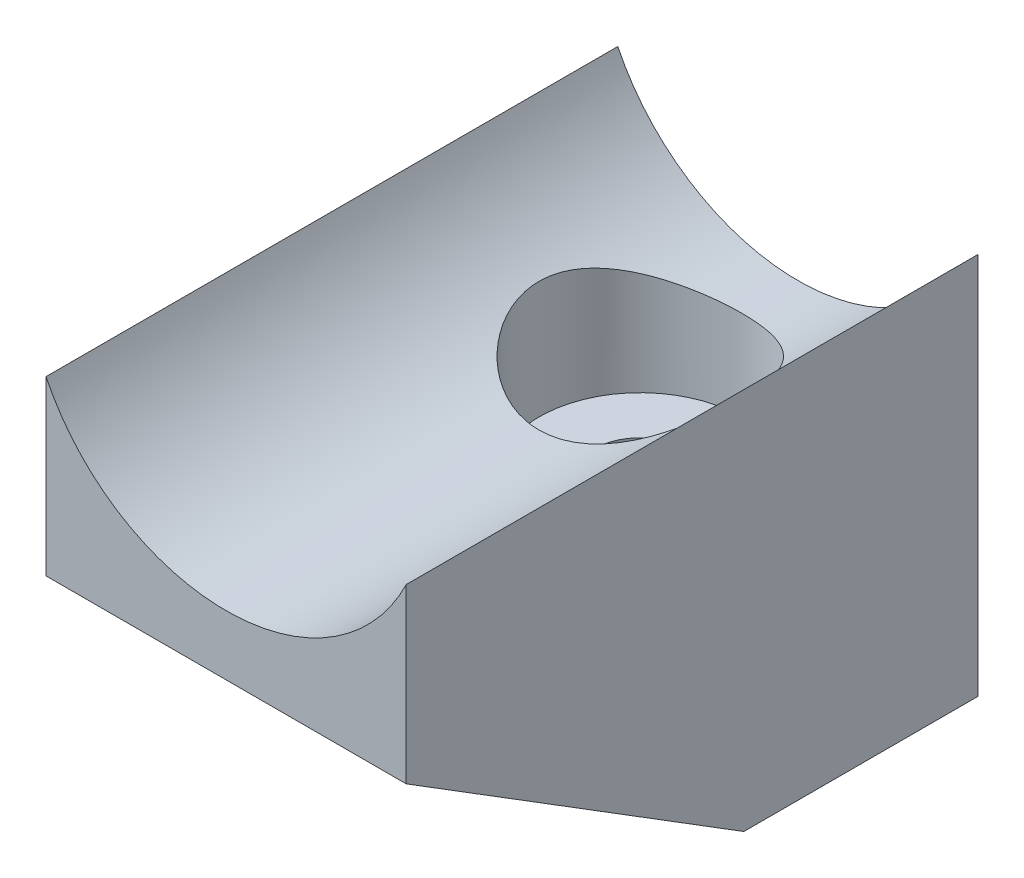
ISO-10303-21;
HEADER;
FILE_DESCRIPTION(('STEP AP214'),'2;1');
FILE_NAME('part.step','',(''),(''),'','','');
FILE_SCHEMA(('AUTOMOTIVE_DESIGN { 1 0 10303 214 1 1 1 1 }'));
ENDSEC;
DATA;
#1=APPLICATION_CONTEXT('core data for automotive mechanical design processes');
#2=APPLICATION_PROTOCOL_DEFINITION('international standard','automotive_design',2000,#1);
#3=PRODUCT_CONTEXT('',#1,'mechanical');
#4=PRODUCT('Part','Part','',(#3));
#5=PRODUCT_RELATED_PRODUCT_CATEGORY('part','',(#4));
#6=PRODUCT_DEFINITION_FORMATION('','',#4);
#7=PRODUCT_DEFINITION_CONTEXT('part definition',#1,'design');
#8=PRODUCT_DEFINITION('design','',#6,#7);
#9=PRODUCT_DEFINITION_SHAPE('','',#8);
#10=(LENGTH_UNIT() NAMED_UNIT(*) SI_UNIT(.MILLI.,.METRE.));
#11=(NAMED_UNIT(*) PLANE_ANGLE_UNIT() SI_UNIT($,.RADIAN.));
#12=(NAMED_UNIT(*) SI_UNIT($,.STERADIAN.) SOLID_ANGLE_UNIT());
#13=UNCERTAINTY_MEASURE_WITH_UNIT(LENGTH_MEASURE(1.E-05),#10,'distance_accuracy_value','');
#14=(GEOMETRIC_REPRESENTATION_CONTEXT(3) GLOBAL_UNCERTAINTY_ASSIGNED_CONTEXT((#13)) GLOBAL_UNIT_ASSIGNED_CONTEXT((#10,
#11,#12)) REPRESENTATION_CONTEXT('',''));
#15=CARTESIAN_POINT('',(0.,0.,0.));
#16=DIRECTION('',(0.,0.,1.));
#17=DIRECTION('',(1.,0.,0.));
#18=AXIS2_PLACEMENT_3D('',#15,#16,#17);
#19=CARTESIAN_POINT('',(24.,62.670050428109,76.2));
#20=DIRECTION('',(0.,0.,-1.));
#21=DIRECTION('',(-1.,0.,0.));
#22=AXIS2_PLACEMENT_3D('',#19,#20,#21);
#23=CYLINDRICAL_SURFACE('',#22,26.6868896088437);
#24=CARTESIAN_POINT('',(24.,62.670050428109,0.));
#25=DIRECTION('',(0.,0.,-1.));
#26=DIRECTION('',(1.,0.,0.));
#27=AXIS2_PLACEMENT_3D('',#24,#25,#26);
#28=CIRCLE('',#27,26.6868896088437);
#29=CARTESIAN_POINT('',(48.,51.,0.));
#30=VERTEX_POINT('',#29);
#31=CARTESIAN_POINT('',(0.,51.,0.));
#32=VERTEX_POINT('',#31);
#33=EDGE_CURVE('E108',#30,#32,#28,.T.);
#34=ORIENTED_EDGE('',*,*,#33,.T.);
#35=DIRECTION('',(0.,0.,-1.));
#36=VECTOR('',#35,1.);
#37=CARTESIAN_POINT('',(0.,51.,76.2));
#38=LINE('',#37,#36);
#39=CARTESIAN_POINT('',(0.,51.,76.2));
#40=VERTEX_POINT('',#39);
#41=EDGE_CURVE('E55',#40,#32,#38,.T.);
#42=ORIENTED_EDGE('',*,*,#41,.F.);
#43=CARTESIAN_POINT('',(24.,62.670050428109,76.2));
#44=DIRECTION('',(0.,0.,-1.));
#45=DIRECTION('',(1.,0.,0.));
#46=AXIS2_PLACEMENT_3D('',#43,#44,#45);
#47=CIRCLE('',#46,26.6868896088437);
#48=CARTESIAN_POINT('',(48.,51.,76.2));
#49=VERTEX_POINT('',#48);
#50=EDGE_CURVE('E101',#49,#40,#47,.T.);
#51=ORIENTED_EDGE('',*,*,#50,.F.);
#52=DIRECTION('',(0.,0.,-1.));
#53=VECTOR('',#52,1.);
#54=CARTESIAN_POINT('',(48.,51.,76.2));
#55=LINE('',#54,#53);
#56=EDGE_CURVE('E93',#49,#30,#55,.T.);
#57=ORIENTED_EDGE('',*,*,#56,.T.);
#58=EDGE_LOOP('',(#34,#42,#51,#57));
#59=FACE_BOUND('',#58,.T.);
#60=CARTESIAN_POINT('',(24.,35.9831608192654,34.5));
#61=CARTESIAN_POINT('',(24.3545168922656,35.9831615861784,34.4999991909589));
#62=CARTESIAN_POINT('',(24.709051061294,35.990241311748,34.4860195699691));
#63=CARTESIAN_POINT('',(25.4155018294641,36.0183811941175,34.4302631423497));
#64=CARTESIAN_POINT('',(25.767417267836,36.0394472159397,34.3884746743237));
#65=CARTESIAN_POINT('',(26.4664042961286,36.0950612341794,34.277510312245));
#66=CARTESIAN_POINT('',(26.8134670600813,36.1296311401494,34.208289908227));
#67=CARTESIAN_POINT('',(27.4996470626531,36.2113669118725,34.0432736656327));
#68=CARTESIAN_POINT('',(27.8387650592039,36.2585315707184,33.9474803734011));
#69=CARTESIAN_POINT('',(28.5055452124013,36.3640883544315,33.7307689424102));
#70=CARTESIAN_POINT('',(28.8332472756115,36.4224354648404,33.6099513854088));
#71=CARTESIAN_POINT('',(29.4766739557101,36.5491077237899,33.3441169042419));
#72=CARTESIAN_POINT('',(29.7923983272893,36.6174330765514,33.1990994847786));
#73=CARTESIAN_POINT('',(30.4100956270777,36.7624960198129,32.8861478941254));
#74=CARTESIAN_POINT('',(30.7120733875401,36.8392306214373,32.7182218601177));
#75=CARTESIAN_POINT('',(31.3010923622123,36.9994965280862,32.3605819585122));
#76=CARTESIAN_POINT('',(31.588127619247,37.0830305103295,32.1708594964751));
#77=CARTESIAN_POINT('',(32.1630185771233,37.2603839740785,31.7586146388262));
#78=CARTESIAN_POINT('',(32.4498463788404,37.3545200613569,31.5347946357657));
#79=CARTESIAN_POINT('',(33.0038766029238,37.5462324440094,31.0653887148281));
#80=CARTESIAN_POINT('',(33.2710778711494,37.6438089411988,30.8198015187994));
#81=CARTESIAN_POINT('',(33.7848201016991,37.8401683131607,30.3079989956314));
#82=CARTESIAN_POINT('',(34.0313477367367,37.9389519198026,30.0417705716799));
#83=CARTESIAN_POINT('',(34.5024312231441,38.1352963647351,29.4900268728071));
#84=CARTESIAN_POINT('',(34.7269829018291,38.2328569677535,29.2045079524324));
#85=CARTESIAN_POINT('',(35.1699720506691,38.4319521838738,28.5918274138243));
#86=CARTESIAN_POINT('',(35.3864751819587,38.5331780947667,28.2631624862355));
#87=CARTESIAN_POINT('',(35.7907277037894,38.7280544889204,27.586648574839));
#88=CARTESIAN_POINT('',(35.9784892902649,38.8217081773076,27.2388078136353));
#89=CARTESIAN_POINT('',(36.3236307690774,38.9982151898863,26.5258409549463));
#90=CARTESIAN_POINT('',(36.4810200574447,39.0810718516817,26.1607202468844));
#91=CARTESIAN_POINT('',(36.7637194515726,39.2328295503982,25.415454727175));
#92=CARTESIAN_POINT('',(36.8890331961182,39.3017321701393,25.0353116253845));
#93=CARTESIAN_POINT('',(37.0993507673323,39.4190136794484,24.2861967623666));
#94=CARTESIAN_POINT('',(37.1863308973663,39.4683802281458,23.9179353492728));
#95=CARTESIAN_POINT('',(37.3292605202717,39.5501951807291,23.1735685323407));
#96=CARTESIAN_POINT('',(37.3852113704497,39.5826443246251,22.7974634723521));
#97=CARTESIAN_POINT('',(37.4651652033413,39.6291833599241,22.0410710013739));
#98=CARTESIAN_POINT('',(37.489196379894,39.6432894530474,21.6607875808297));
#99=CARTESIAN_POINT('',(37.5049929969948,39.6525495677268,20.8993373090206));
#100=CARTESIAN_POINT('',(37.4967616475938,39.647705474785,20.5181705494175));
#101=CARTESIAN_POINT('',(37.4511898099261,39.6210566722078,19.8054948598745));
#102=CARTESIAN_POINT('',(37.4175640607401,39.601417108501,19.4736585852218));
#103=CARTESIAN_POINT('',(37.326073150977,39.5484447716003,18.814486259784));
#104=CARTESIAN_POINT('',(37.2682103364095,39.5151133237085,18.4871497766112));
#105=CARTESIAN_POINT('',(37.1289044025548,39.4358439596187,17.8390214036895));
#106=CARTESIAN_POINT('',(37.0474550963332,39.3899027359359,17.5182312547634));
#107=CARTESIAN_POINT('',(36.8618333850982,39.2868390645032,16.8851398621328));
#108=CARTESIAN_POINT('',(36.7576597457257,39.2297160093866,16.5728390805976));
#109=CARTESIAN_POINT('',(36.5248980641398,39.1045066297101,15.9512795539168));
#110=CARTESIAN_POINT('',(36.3958045312396,39.0361987642994,15.6422551561775));
#111=CARTESIAN_POINT('',(36.115832110094,38.8914567094809,15.0360987980012));
#112=CARTESIAN_POINT('',(35.964945442354,38.8150196207646,14.7389711329216));
#113=CARTESIAN_POINT('',(35.6424173752091,38.6559604078624,14.1578834124609));
#114=CARTESIAN_POINT('',(35.4707727558245,38.5733373248623,13.8739254094375));
#115=CARTESIAN_POINT('',(35.1077132820177,38.4038409953922,13.3202659925263));
#116=CARTESIAN_POINT('',(34.9162968067572,38.3169674007856,13.0505657501918));
#117=CARTESIAN_POINT('',(34.4883879155114,38.1293649943085,12.4921766786246));
#118=CARTESIAN_POINT('',(34.2492730002358,38.028307628818,12.2056033279976));
#119=CARTESIAN_POINT('',(33.7483235254508,37.8258715811049,11.6533897207553));
#120=CARTESIAN_POINT('',(33.4864968126558,37.7244930214228,11.3877422944754));
#121=CARTESIAN_POINT('',(32.9410601476642,37.5238375277325,10.8783998828797));
#122=CARTESIAN_POINT('',(32.6574308029506,37.4245625672699,10.6347248695997));
#123=CARTESIAN_POINT('',(32.0700535657442,37.2307124069187,10.1711422932667));
#124=CARTESIAN_POINT('',(31.7663137527786,37.1361353460242,9.95122527759971));
#125=CARTESIAN_POINT('',(31.1247492971937,36.949533500332,9.52641745511602));
#126=CARTESIAN_POINT('',(30.7859840246619,36.8578601822433,9.32278886638107));
#127=CARTESIAN_POINT('',(30.0898069833388,36.6848052751529,8.94508088963663));
#128=CARTESIAN_POINT('',(29.732394312816,36.6034241845048,8.77100293234046));
#129=CARTESIAN_POINT('',(29.0015565756526,36.4533848244153,8.45436693095004));
#130=CARTESIAN_POINT('',(28.6281420955954,36.3847182984525,8.3117884201975));
#131=CARTESIAN_POINT('',(27.8679441022921,36.2621493364688,8.05977972511412));
#132=CARTESIAN_POINT('',(27.481162174051,36.2082451567649,7.95034562570555));
#133=CARTESIAN_POINT('',(26.730510684222,36.120757599973,7.77388107775459));
#134=CARTESIAN_POINT('',(26.3674507699535,36.0858462458647,7.70405795240964));
#135=CARTESIAN_POINT('',(25.6357242232062,36.0308114865075,7.59435801260333));
#136=CARTESIAN_POINT('',(25.2670579010967,36.0106872656665,7.55447954652597));
#137=CARTESIAN_POINT('',(24.5273297133321,35.9858059030787,7.50521286218164));
#138=CARTESIAN_POINT('',(24.1562689020406,35.9810424061037,7.49581203432147));
#139=CARTESIAN_POINT('',(23.4147667804037,35.9870030503557,7.50759578044219));
#140=CARTESIAN_POINT('',(23.0443254421568,35.9977264741394,7.5287789375969));
#141=CARTESIAN_POINT('',(22.3366645072098,36.032882233218,7.59852757278416));
#142=CARTESIAN_POINT('',(21.9991547183485,36.0561511696852,7.64477077116334));
#143=CARTESIAN_POINT('',(21.3296532379409,36.1149712040489,7.7623737053669));
#144=CARTESIAN_POINT('',(20.9976611826177,36.1505214888586,7.83373177846688));
#145=CARTESIAN_POINT('',(20.3413200715499,36.2330770538366,8.00081715947033));
#146=CARTESIAN_POINT('',(20.0169714344883,36.2800829599165,8.09654579894449));
#147=CARTESIAN_POINT('',(19.3778586204648,36.3844888700361,8.31144274790929));
#148=CARTESIAN_POINT('',(19.0630948494564,36.4418893136086,8.43061204860603));
#149=CARTESIAN_POINT('',(18.4362010732881,36.5675742443026,8.69499745894407));
#150=CARTESIAN_POINT('',(18.1243916874062,36.6361185201823,8.84084954519497));
#151=CARTESIAN_POINT('',(17.5143063717664,36.7813618098472,9.15502134483741));
#152=CARTESIAN_POINT('',(17.2160305535988,36.8580608908551,9.32334124344105));
#153=CARTESIAN_POINT('',(16.6343299370575,37.0179941686797,9.6812743987242));
#154=CARTESIAN_POINT('',(16.3509074273378,37.1012293676986,9.87089092280321));
#155=CARTESIAN_POINT('',(15.8000430526245,37.272530268895,10.2702978254519));
#156=CARTESIAN_POINT('',(15.5326074668793,37.3605978433936,10.4800960475431));
#157=CARTESIAN_POINT('',(14.9890225870845,37.5486827004148,10.940600515902));
#158=CARTESIAN_POINT('',(14.7146682182244,37.6490152957976,11.1932997650636));
#159=CARTESIAN_POINT('',(14.1879861958907,37.850823727682,11.7202812000566));
#160=CARTESIAN_POINT('',(13.9356595779506,37.9522996176773,11.994564399407));
#161=CARTESIAN_POINT('',(13.4541383287783,38.1538710918882,12.5635443693569));
#162=CARTESIAN_POINT('',(13.2249586175641,38.2539657503585,12.8582541027253));
#163=CARTESIAN_POINT('',(12.7911739590101,38.450038622912,13.4666199611177));
#164=CARTESIAN_POINT('',(12.5865733146525,38.5460161143301,13.7802793892036));
#165=CARTESIAN_POINT('',(12.1933998129523,38.7358826995701,14.4418133224312));
#166=CARTESIAN_POINT('',(12.0062109332154,38.8294045493946,14.790618759068));
#167=CARTESIAN_POINT('',(11.6623771618318,39.005510245804,15.505433412593));
#168=CARTESIAN_POINT('',(11.5057173795471,39.088099418491,15.8714341337792));
#169=CARTESIAN_POINT('',(11.2247008551348,39.2391463303452,16.6181380342054));
#170=CARTESIAN_POINT('',(11.1003175917222,39.3076156620821,16.9988288453626));
#171=CARTESIAN_POINT('',(10.8854029647511,39.4275758707837,17.7722524901686));
#172=CARTESIAN_POINT('',(10.7948662113385,39.4790694508807,18.1649833957177));
#173=CARTESIAN_POINT('',(10.6561267576302,39.5586491424488,18.9205744290029));
#174=CARTESIAN_POINT('',(10.6046780477776,39.5885166525649,19.2826527075454));
#175=CARTESIAN_POINT('',(10.5313211802591,39.6312441081643,20.0107881246009));
#176=CARTESIAN_POINT('',(10.509410990211,39.6441052237624,20.3768449876221));
#177=CARTESIAN_POINT('',(10.4954740023248,39.6522764764849,21.1095737175751));
#178=CARTESIAN_POINT('',(10.503435261136,39.6475936281251,21.4762452801338));
#179=CARTESIAN_POINT('',(10.5490897229159,39.620890170366,22.2070818616433));
#180=CARTESIAN_POINT('',(10.5867815976845,39.5988703354877,22.5712469918345));
#181=CARTESIAN_POINT('',(10.6860826613011,39.5414407934675,23.2577917308372));
#182=CARTESIAN_POINT('',(10.7449235415983,39.5075900786618,23.5807085776182));
#183=CARTESIAN_POINT('',(10.8855671252424,39.4276695911269,24.2200652963903));
#184=CARTESIAN_POINT('',(10.9673773966461,39.3815957913575,24.5365029966712));
#185=CARTESIAN_POINT('',(11.1531218585926,39.2786191480073,25.1609927782122));
#186=CARTESIAN_POINT('',(11.2570564041588,39.2217161306539,25.4690447248185));
#187=CARTESIAN_POINT('',(11.486139139716,39.0986640048262,26.0752639808374));
#188=CARTESIAN_POINT('',(11.6112894541966,39.0325139704972,26.3734302967513));
#189=CARTESIAN_POINT('',(11.8909193945348,38.8879850391091,26.978164054598));
#190=CARTESIAN_POINT('',(12.0468014576588,38.8090839774117,27.2839579780352));
#191=CARTESIAN_POINT('',(12.380521423239,38.6448059051049,27.8814851759033));
#192=CARTESIAN_POINT('',(12.5583599867256,38.5594286995524,28.1732180266386));
#193=CARTESIAN_POINT('',(12.9350050486284,38.3842705285657,28.7415861151865));
#194=CARTESIAN_POINT('',(13.1338195118093,38.2944878973183,29.0182155571392));
#195=CARTESIAN_POINT('',(13.55138134216,38.1126011432872,29.5552372324975));
#196=CARTESIAN_POINT('',(13.7701317115013,38.0204966723707,29.8156270103755));
#197=CARTESIAN_POINT('',(14.2553044238973,37.824371499012,30.3507876265148));
#198=CARTESIAN_POINT('',(14.5242625460148,37.7203085671914,30.6232503094018));
#199=CARTESIAN_POINT('',(15.0847401514354,37.5145877070041,31.1446837816574));
#200=CARTESIAN_POINT('',(15.3762526731044,37.4129290490847,31.3936617675669));
#201=CARTESIAN_POINT('',(15.9807241251489,37.2145492490189,31.8668598341262));
#202=CARTESIAN_POINT('',(16.2937000515237,37.1178321281315,32.0910599186005));
#203=CARTESIAN_POINT('',(16.9392532342463,36.9319710167232,32.5127966404364));
#204=CARTESIAN_POINT('',(17.2718294134981,36.8428266107138,32.7103347409991));
#205=CARTESIAN_POINT('',(17.9580699491092,36.6736806890239,33.0788338832846));
#206=CARTESIAN_POINT('',(18.3119092953236,36.5937775342833,33.2495149413648));
#207=CARTESIAN_POINT('',(19.0354099123127,36.4464122330277,33.5601684893493));
#208=CARTESIAN_POINT('',(19.4050734219009,36.3789518541406,33.7001366166921));
#209=CARTESIAN_POINT('',(20.1564767497158,36.2586550060071,33.9473304215354));
#210=CARTESIAN_POINT('',(20.5381841879863,36.2057825230111,34.0546368013575));
#211=CARTESIAN_POINT('',(21.3111772199415,36.1161143552267,34.2354686575648));
#212=CARTESIAN_POINT('',(21.7024569041025,36.0793090031646,34.3090144484033));
#213=CARTESIAN_POINT('',(22.4113585118581,36.0286190913733,34.4099680831778));
#214=CARTESIAN_POINT('',(22.7278732674336,36.0116044092087,34.4436987632124));
#215=CARTESIAN_POINT('',(23.3629206625685,35.9888747745249,34.4887153911502));
#216=CARTESIAN_POINT('',(23.6814533569209,35.9831601301654,34.5000007269536));
#217=CARTESIAN_POINT('',(24.,35.9831608192654,34.5));
#218=B_SPLINE_CURVE_WITH_KNOTS('',3,(#60,#61,#62,#63,#64,#65,#66,#67,#68,#69,#70,#71,#72,#73,
#74,#75,#76,#77,#78,#79,#80,#81,#82,#83,#84,#85,#86,#87,#88,#89,#90,#91,#92,#93,#94,#95,#96,#97,
#98,#99,#100,#101,#102,#103,#104,#105,#106,#107,#108,#109,#110,#111,#112,#113,#114,#115,#116,
#117,#118,#119,#120,#121,#122,#123,#124,#125,#126,#127,#128,#129,#130,#131,#132,#133,#134,#135,
#136,#137,#138,#139,#140,#141,#142,#143,#144,#145,#146,#147,#148,#149,#150,#151,#152,#153,#154,
#155,#156,#157,#158,#159,#160,#161,#162,#163,#164,#165,#166,#167,#168,#169,#170,#171,#172,#173,
#174,#175,#176,#177,#178,#179,#180,#181,#182,#183,#184,#185,#186,#187,#188,#189,#190,#191,#192,
#193,#194,#195,#196,#197,#198,#199,#200,#201,#202,#203,#204,#205,#206,#207,#208,#209,#210,#211,
#212,#213,#214,#215,#216,#217),.UNSPECIFIED.,.T.,.F.,(4,2,2,2,2,2,2,2,2,2,2,2,2,2,2,2,2,2,2,2,2,
2,2,2,2,2,2,2,2,2,2,2,2,2,2,2,2,2,2,2,2,2,2,2,2,2,2,2,2,2,2,2,2,2,2,2,2,2,2,2,2,2,2,2,2,2,2,2,2,
2,2,2,2,2,2,2,2,2,4),(0.,1.0632369029349,2.12691994614412,3.19233599210545,4.25764997991234,
5.31876239876248,6.37989653802912,7.44065473714085,8.50183264335347,9.62804849092372,
10.7543305128297,11.8813331002327,13.0085492637646,14.2261589052341,15.4432504360834,
16.6599648395108,17.8765411524945,19.0196967067471,20.1628022522706,21.3048974487127,
22.4468790120606,23.4480380404462,24.4491001847441,25.4504251542558,26.4518045281153,
27.4761680404588,28.50089812773,29.5257873758165,30.5507607080687,31.7095015670352,
32.8678436742891,34.0272282721096,35.186149872433,36.401792487965,37.6174939428607,
38.8324031614806,40.0471688168107,41.1597455263258,42.2722608664829,43.3843158639715,
44.4963193463266,45.5195027107501,46.5426183482969,47.5657898993287,48.5890047252484,
49.6408745676053,50.6927530815256,51.7447931991885,52.797243851995,53.9547499101515,
55.1123103538699,56.2706122380514,57.429116608003,58.6477790944877,59.8658456795539,
61.0829081996147,62.2997768271207,63.3990278846275,64.4982033048877,65.5969392942254,
66.6956262008803,67.6844563486313,68.673612683639,69.6627848926275,70.6520562132205,
71.7075436262047,72.7630628238316,73.8189842653076,74.875064982821,76.0639274713683,
77.2524244587852,78.4418736849924,79.6312576080442,80.8323192447209,82.0335513736992,
83.2317908813542,84.4293084350365,85.3846403745673,86.3399983662931),.UNSPECIFIED.);
#219=CARTESIAN_POINT('',(24.,35.9831608192654,34.5));
#220=VERTEX_POINT('',#219);
#221=EDGE_CURVE('E46',#220,#220,#218,.T.);
#222=ORIENTED_EDGE('',*,*,#221,.F.);
#223=EDGE_LOOP('',(#222));
#224=FACE_BOUND('',#223,.T.);
#225=ADVANCED_FACE('F42',(#59,#224),#23,.F.);
#226=CARTESIAN_POINT('',(0.,51.,76.2));
#227=DIRECTION('',(1.,0.,0.));
#228=DIRECTION('',(0.,1.,0.));
#229=AXIS2_PLACEMENT_3D('',#226,#227,#228);
#230=PLANE('',#229);
#231=DIRECTION('',(0.,-0.528301886792453,-0.849056603773585));
#232=VECTOR('',#231,1.);
#233=CARTESIAN_POINT('',(0.,34.4193663225347,86.5168387326451));
#234=LINE('',#233,#232);
#235=CARTESIAN_POINT('',(0.,28.,76.2));
#236=VERTEX_POINT('',#235);
#237=CARTESIAN_POINT('',(0.,0.,31.2));
#238=VERTEX_POINT('',#237);
#239=EDGE_CURVE('E114',#236,#238,#234,.T.);
#240=ORIENTED_EDGE('',*,*,#239,.F.);
#241=DIRECTION('',(0.,-1.,0.));
#242=VECTOR('',#241,1.);
#243=CARTESIAN_POINT('',(0.,51.,76.2));
#244=LINE('',#243,#242);
#245=EDGE_CURVE('E143',#40,#236,#244,.T.);
#246=ORIENTED_EDGE('',*,*,#245,.F.);
#247=ORIENTED_EDGE('',*,*,#41,.T.);
#248=DIRECTION('',(0.,-1.,0.));
#249=VECTOR('',#248,1.);
#250=CARTESIAN_POINT('',(0.,51.,0.));
#251=LINE('',#250,#249);
#252=CARTESIAN_POINT('',(0.,0.,0.));
#253=VERTEX_POINT('',#252);
#254=EDGE_CURVE('E112',#32,#253,#251,.T.);
#255=ORIENTED_EDGE('',*,*,#254,.T.);
#256=DIRECTION('',(0.,0.,-1.));
#257=VECTOR('',#256,1.);
#258=CARTESIAN_POINT('',(0.,0.,76.2));
#259=LINE('',#258,#257);
#260=EDGE_CURVE('E125',#238,#253,#259,.T.);
#261=ORIENTED_EDGE('',*,*,#260,.F.);
#262=EDGE_LOOP('',(#240,#246,#247,#255,#261));
#263=FACE_BOUND('',#262,.T.);
#264=ADVANCED_FACE('F149',(#263),#230,.F.);
#265=CARTESIAN_POINT('',(0.,0.,76.2));
#266=DIRECTION('',(0.,1.,0.));
#267=DIRECTION('',(0.,0.,1.));
#268=AXIS2_PLACEMENT_3D('',#265,#266,#267);
#269=PLANE('',#268);
#270=CARTESIAN_POINT('',(24.,0.,21.));
#271=DIRECTION('',(0.,-1.,0.));
#272=DIRECTION('',(0.,0.,-1.));
#273=AXIS2_PLACEMENT_3D('',#270,#271,#272);
#274=CIRCLE('',#273,6.15);
#275=CARTESIAN_POINT('',(24.,0.,14.85));
#276=VERTEX_POINT('',#275);
#277=EDGE_CURVE('E133',#276,#276,#274,.T.);
#278=ORIENTED_EDGE('',*,*,#277,.F.);
#279=EDGE_LOOP('',(#278));
#280=FACE_BOUND('',#279,.T.);
#281=DIRECTION('',(1.,0.,0.));
#282=VECTOR('',#281,1.);
#283=CARTESIAN_POINT('',(-1.2,0.,31.2));
#284=LINE('',#283,#282);
#285=CARTESIAN_POINT('',(48.,0.,31.2));
#286=VERTEX_POINT('',#285);
#287=EDGE_CURVE('E118',#238,#286,#284,.T.);
#288=ORIENTED_EDGE('',*,*,#287,.F.);
#289=ORIENTED_EDGE('',*,*,#260,.T.);
#290=DIRECTION('',(1.,0.,0.));
#291=VECTOR('',#290,1.);
#292=CARTESIAN_POINT('',(0.,0.,0.));
#293=LINE('',#292,#291);
#294=CARTESIAN_POINT('',(48.,0.,0.));
#295=VERTEX_POINT('',#294);
#296=EDGE_CURVE('E102',#253,#295,#293,.T.);
#297=ORIENTED_EDGE('',*,*,#296,.T.);
#298=DIRECTION('',(0.,0.,-1.));
#299=VECTOR('',#298,1.);
#300=CARTESIAN_POINT('',(48.,0.,76.2));
#301=LINE('',#300,#299);
#302=EDGE_CURVE('E96',#286,#295,#301,.T.);
#303=ORIENTED_EDGE('',*,*,#302,.F.);
#304=EDGE_LOOP('',(#288,#289,#297,#303));
#305=FACE_BOUND('',#304,.T.);
#306=ADVANCED_FACE('F156',(#280,#305),#269,.F.);
#307=CARTESIAN_POINT('',(48.,0.,76.2));
#308=DIRECTION('',(-1.,0.,0.));
#309=DIRECTION('',(0.,0.,1.));
#310=AXIS2_PLACEMENT_3D('',#307,#308,#309);
#311=PLANE('',#310);
#312=DIRECTION('',(0.,-0.528301886792453,-0.849056603773585));
#313=VECTOR('',#312,1.);
#314=CARTESIAN_POINT('',(48.,0.,31.2));
#315=LINE('',#314,#313);
#316=CARTESIAN_POINT('',(48.,28.,76.2));
#317=VERTEX_POINT('',#316);
#318=EDGE_CURVE('E63',#317,#286,#315,.T.);
#319=ORIENTED_EDGE('',*,*,#318,.T.);
#320=ORIENTED_EDGE('',*,*,#302,.T.);
#321=DIRECTION('',(0.,1.,0.));
#322=VECTOR('',#321,1.);
#323=CARTESIAN_POINT('',(48.,0.,0.));
#324=LINE('',#323,#322);
#325=EDGE_CURVE('E90',#295,#30,#324,.T.);
#326=ORIENTED_EDGE('',*,*,#325,.T.);
#327=ORIENTED_EDGE('',*,*,#56,.F.);
#328=DIRECTION('',(0.,1.,0.));
#329=VECTOR('',#328,1.);
#330=CARTESIAN_POINT('',(48.,0.,76.2));
#331=LINE('',#330,#329);
#332=EDGE_CURVE('E70',#317,#49,#331,.T.);
#333=ORIENTED_EDGE('',*,*,#332,.F.);
#334=EDGE_LOOP('',(#319,#320,#326,#327,#333));
#335=FACE_BOUND('',#334,.T.);
#336=ADVANCED_FACE('F92',(#335),#311,.F.);
#337=CARTESIAN_POINT('',(24.,62.670050428109,76.2));
#338=DIRECTION('',(0.,0.,1.));
#339=DIRECTION('',(1.,0.,0.));
#340=AXIS2_PLACEMENT_3D('',#337,#338,#339);
#341=PLANE('',#340);
#342=ORIENTED_EDGE('',*,*,#245,.T.);
#343=DIRECTION('',(1.,0.,0.));
#344=VECTOR('',#343,1.);
#345=CARTESIAN_POINT('',(24.,28.,76.2));
#346=LINE('',#345,#344);
#347=EDGE_CURVE('E11',#236,#317,#346,.T.);
#348=ORIENTED_EDGE('',*,*,#347,.T.);
#349=ORIENTED_EDGE('',*,*,#332,.T.);
#350=ORIENTED_EDGE('',*,*,#50,.T.);
#351=EDGE_LOOP('',(#342,#348,#349,#350));
#352=FACE_BOUND('',#351,.T.);
#353=ADVANCED_FACE('F145',(#352),#341,.T.);
#354=CARTESIAN_POINT('',(24.,62.670050428109,0.));
#355=DIRECTION('',(0.,0.,1.));
#356=DIRECTION('',(1.,0.,0.));
#357=AXIS2_PLACEMENT_3D('',#354,#355,#356);
#358=PLANE('',#357);
#359=ORIENTED_EDGE('',*,*,#33,.F.);
#360=ORIENTED_EDGE('',*,*,#325,.F.);
#361=ORIENTED_EDGE('',*,*,#296,.F.);
#362=ORIENTED_EDGE('',*,*,#254,.F.);
#363=EDGE_LOOP('',(#359,#360,#361,#362));
#364=FACE_BOUND('',#363,.T.);
#365=ADVANCED_FACE('F110',(#364),#358,.F.);
#366=CARTESIAN_POINT('',(-1.2,0.,31.2));
#367=DIRECTION('',(0.,-0.849056603773585,0.528301886792453));
#368=DIRECTION('',(0.,-0.528301886792453,-0.849056603773585));
#369=AXIS2_PLACEMENT_3D('',#366,#367,#368);
#370=PLANE('',#369);
#371=ORIENTED_EDGE('',*,*,#239,.T.);
#372=ORIENTED_EDGE('',*,*,#287,.T.);
#373=ORIENTED_EDGE('',*,*,#318,.F.);
#374=ORIENTED_EDGE('',*,*,#347,.F.);
#375=EDGE_LOOP('',(#371,#372,#373,#374));
#376=FACE_BOUND('',#375,.T.);
#377=ADVANCED_FACE('F152',(#376),#370,.T.);
#378=CARTESIAN_POINT('',(24.,44.,21.));
#379=DIRECTION('',(0.,-1.,0.));
#380=DIRECTION('',(0.,0.,-1.));
#381=AXIS2_PLACEMENT_3D('',#378,#379,#380);
#382=CYLINDRICAL_SURFACE('',#381,6.15);
#383=CARTESIAN_POINT('',(24.,24.,21.));
#384=DIRECTION('',(0.,-1.,0.));
#385=DIRECTION('',(0.,0.,-1.));
#386=AXIS2_PLACEMENT_3D('',#383,#384,#385);
#387=CIRCLE('',#386,6.15);
#388=CARTESIAN_POINT('',(24.,24.,14.85));
#389=VERTEX_POINT('',#388);
#390=EDGE_CURVE('E127',#389,#389,#387,.F.);
#391=ORIENTED_EDGE('',*,*,#390,.T.);
#392=EDGE_LOOP('',(#391));
#393=FACE_BOUND('',#392,.T.);
#394=ORIENTED_EDGE('',*,*,#277,.T.);
#395=EDGE_LOOP('',(#394));
#396=FACE_BOUND('',#395,.T.);
#397=ADVANCED_FACE('F195',(#393,#396),#382,.F.);
#398=CARTESIAN_POINT('',(24.,24.,21.));
#399=DIRECTION('',(0.,1.,0.));
#400=DIRECTION('',(0.,0.,1.));
#401=AXIS2_PLACEMENT_3D('',#398,#399,#400);
#402=CYLINDRICAL_SURFACE('',#401,13.5);
#403=CARTESIAN_POINT('',(24.,24.,21.));
#404=DIRECTION('',(0.,-1.,0.));
#405=DIRECTION('',(0.,0.,-1.));
#406=AXIS2_PLACEMENT_3D('',#403,#404,#405);
#407=CIRCLE('',#406,13.5);
#408=CARTESIAN_POINT('',(24.,24.,7.5));
#409=VERTEX_POINT('',#408);
#410=EDGE_CURVE('E129',#409,#409,#407,.T.);
#411=ORIENTED_EDGE('',*,*,#410,.T.);
#412=EDGE_LOOP('',(#411));
#413=FACE_BOUND('',#412,.T.);
#414=ORIENTED_EDGE('',*,*,#221,.T.);
#415=EDGE_LOOP('',(#414));
#416=FACE_BOUND('',#415,.T.);
#417=ADVANCED_FACE('F202',(#413,#416),#402,.F.);
#418=CARTESIAN_POINT('',(24.,24.,21.));
#419=DIRECTION('',(0.,-1.,0.));
#420=DIRECTION('',(0.,0.,-1.));
#421=AXIS2_PLACEMENT_3D('',#418,#419,#420);
#422=PLANE('',#421);
#423=ORIENTED_EDGE('',*,*,#410,.F.);
#424=EDGE_LOOP('',(#423));
#425=FACE_BOUND('',#424,.T.);
#426=ORIENTED_EDGE('',*,*,#390,.F.);
#427=EDGE_LOOP('',(#426));
#428=FACE_BOUND('',#427,.T.);
#429=ADVANCED_FACE('F209',(#425,#428),#422,.F.);
#430=CLOSED_SHELL('',(#225,#264,#306,#336,#353,#365,#377,#397,#417,#429));
#431=MANIFOLD_SOLID_BREP('B2',#430);
#432=ADVANCED_BREP_SHAPE_REPRESENTATION('',(#18,#431),#14);
#433=SHAPE_DEFINITION_REPRESENTATION(#9,#432);
ENDSEC;
END-ISO-10303-21;
